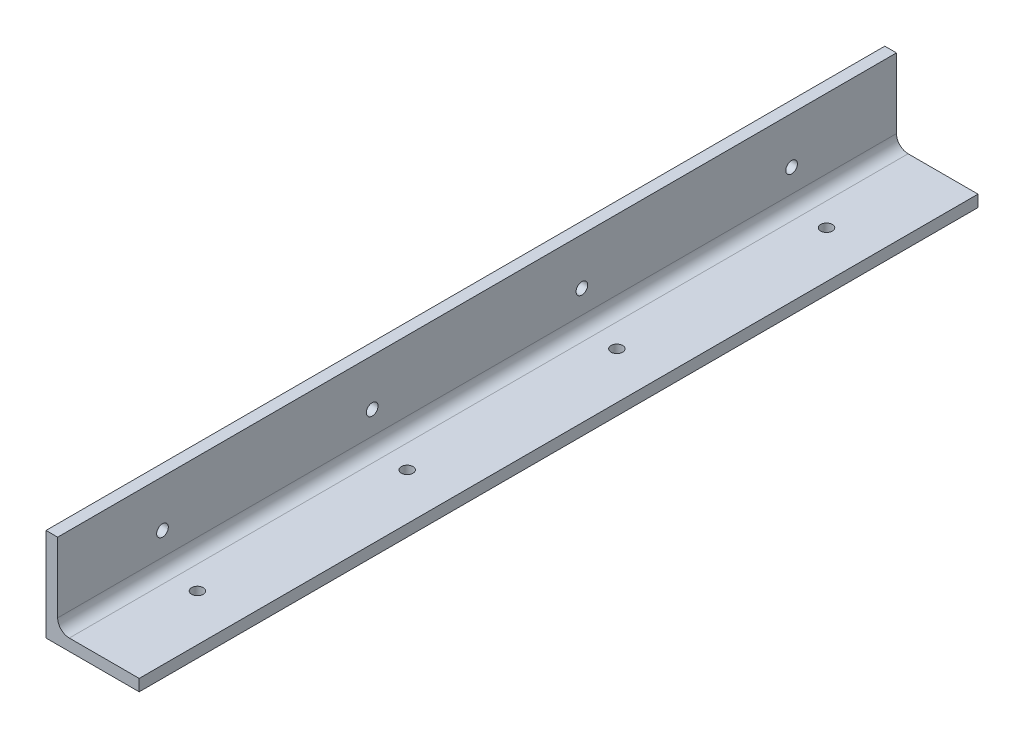
ISO-10303-21;
HEADER;
FILE_DESCRIPTION(('STEP AP214'),'2;1');
FILE_NAME('part.step','',(''),(''),'','','');
FILE_SCHEMA(('AUTOMOTIVE_DESIGN { 1 0 10303 214 1 1 1 1 }'));
ENDSEC;
DATA;
#1=APPLICATION_CONTEXT('core data for automotive mechanical design processes');
#2=APPLICATION_PROTOCOL_DEFINITION('international standard','automotive_design',2000,#1);
#3=PRODUCT_CONTEXT('',#1,'mechanical');
#4=PRODUCT('Part','Part','',(#3));
#5=PRODUCT_RELATED_PRODUCT_CATEGORY('part','',(#4));
#6=PRODUCT_DEFINITION_FORMATION('','',#4);
#7=PRODUCT_DEFINITION_CONTEXT('part definition',#1,'design');
#8=PRODUCT_DEFINITION('design','',#6,#7);
#9=PRODUCT_DEFINITION_SHAPE('','',#8);
#10=(LENGTH_UNIT() NAMED_UNIT(*) SI_UNIT(.MILLI.,.METRE.));
#11=(NAMED_UNIT(*) PLANE_ANGLE_UNIT() SI_UNIT($,.RADIAN.));
#12=(NAMED_UNIT(*) SI_UNIT($,.STERADIAN.) SOLID_ANGLE_UNIT());
#13=UNCERTAINTY_MEASURE_WITH_UNIT(LENGTH_MEASURE(1.E-05),#10,'distance_accuracy_value','');
#14=(GEOMETRIC_REPRESENTATION_CONTEXT(3) GLOBAL_UNCERTAINTY_ASSIGNED_CONTEXT((#13)) GLOBAL_UNIT_ASSIGNED_CONTEXT((#10,
#11,#12)) REPRESENTATION_CONTEXT('',''));
#15=CARTESIAN_POINT('',(0.,0.,0.));
#16=DIRECTION('',(0.,0.,1.));
#17=DIRECTION('',(1.,0.,0.));
#18=AXIS2_PLACEMENT_3D('',#15,#16,#17);
#19=CARTESIAN_POINT('',(-29.6093607133629,-1.95308723282948,57.15));
#20=DIRECTION('',(-1.,0.,0.));
#21=DIRECTION('',(0.,0.,1.));
#22=AXIS2_PLACEMENT_3D('',#19,#20,#21);
#23=CYLINDRICAL_SURFACE('',#22,3.17499999999999);
#24=CARTESIAN_POINT('',(-29.6093607133629,-1.95308723282948,57.15));
#25=DIRECTION('',(-1.,0.,0.));
#26=DIRECTION('',(0.,0.,1.));
#27=AXIS2_PLACEMENT_3D('',#24,#25,#26);
#28=CIRCLE('',#27,3.17499999999999);
#29=CARTESIAN_POINT('',(-29.6093607133629,-1.95308723282948,60.325));
#30=VERTEX_POINT('',#29);
#31=EDGE_CURVE('E55',#30,#30,#28,.T.);
#32=ORIENTED_EDGE('',*,*,#31,.T.);
#33=EDGE_LOOP('',(#32));
#34=FACE_BOUND('',#33,.T.);
#35=CARTESIAN_POINT('',(-23.2593607133629,-1.95308723282948,57.15));
#36=DIRECTION('',(-1.,0.,0.));
#37=DIRECTION('',(0.,0.,1.));
#38=AXIS2_PLACEMENT_3D('',#35,#36,#37);
#39=CIRCLE('',#38,3.17499999999999);
#40=CARTESIAN_POINT('',(-23.2593607133629,-1.95308723282948,60.325));
#41=VERTEX_POINT('',#40);
#42=EDGE_CURVE('E11',#41,#41,#39,.T.);
#43=ORIENTED_EDGE('',*,*,#42,.F.);
#44=EDGE_LOOP('',(#43));
#45=FACE_BOUND('',#44,.T.);
#46=ADVANCED_FACE('F47',(#34,#45),#23,.F.);
#47=CARTESIAN_POINT('',(-29.6093607133629,-1.95308723282948,171.45));
#48=DIRECTION('',(-1.,0.,0.));
#49=DIRECTION('',(0.,0.,1.));
#50=AXIS2_PLACEMENT_3D('',#47,#48,#49);
#51=CYLINDRICAL_SURFACE('',#50,3.17499999999999);
#52=CARTESIAN_POINT('',(-29.6093607133629,-1.95308723282948,171.45));
#53=DIRECTION('',(-1.,0.,0.));
#54=DIRECTION('',(0.,0.,1.));
#55=AXIS2_PLACEMENT_3D('',#52,#53,#54);
#56=CIRCLE('',#55,3.17499999999999);
#57=CARTESIAN_POINT('',(-29.6093607133629,-1.95308723282948,174.625));
#58=VERTEX_POINT('',#57);
#59=EDGE_CURVE('E210',#58,#58,#56,.T.);
#60=ORIENTED_EDGE('',*,*,#59,.T.);
#61=EDGE_LOOP('',(#60));
#62=FACE_BOUND('',#61,.T.);
#63=CARTESIAN_POINT('',(-23.2593607133629,-1.95308723282948,171.45));
#64=DIRECTION('',(-1.,0.,0.));
#65=DIRECTION('',(0.,0.,1.));
#66=AXIS2_PLACEMENT_3D('',#63,#64,#65);
#67=CIRCLE('',#66,3.17499999999999);
#68=CARTESIAN_POINT('',(-23.2593607133629,-1.95308723282948,174.625));
#69=VERTEX_POINT('',#68);
#70=EDGE_CURVE('E214',#69,#69,#67,.T.);
#71=ORIENTED_EDGE('',*,*,#70,.F.);
#72=EDGE_LOOP('',(#71));
#73=FACE_BOUND('',#72,.T.);
#74=ADVANCED_FACE('F250',(#62,#73),#51,.F.);
#75=CARTESIAN_POINT('',(-4.20936071336289,-27.3530872328295,57.15));
#76=DIRECTION('',(0.,-1.,0.));
#77=DIRECTION('',(0.,0.,-1.));
#78=AXIS2_PLACEMENT_3D('',#75,#76,#77);
#79=CYLINDRICAL_SURFACE('',#78,3.17499999999999);
#80=CARTESIAN_POINT('',(-4.20936071336289,-21.0030872328295,57.15));
#81=DIRECTION('',(0.,1.,0.));
#82=DIRECTION('',(0.,0.,1.));
#83=AXIS2_PLACEMENT_3D('',#80,#81,#82);
#84=CIRCLE('',#83,3.17499999999999);
#85=CARTESIAN_POINT('',(-4.20936071336289,-21.0030872328295,60.325));
#86=VERTEX_POINT('',#85);
#87=EDGE_CURVE('E202',#86,#86,#84,.T.);
#88=ORIENTED_EDGE('',*,*,#87,.T.);
#89=EDGE_LOOP('',(#88));
#90=FACE_BOUND('',#89,.T.);
#91=CARTESIAN_POINT('',(-4.20936071336289,-27.3530872328295,57.15));
#92=DIRECTION('',(0.,-1.,0.));
#93=DIRECTION('',(0.,0.,-1.));
#94=AXIS2_PLACEMENT_3D('',#91,#92,#93);
#95=CIRCLE('',#94,3.17499999999999);
#96=CARTESIAN_POINT('',(-4.20936071336289,-27.3530872328295,53.975));
#97=VERTEX_POINT('',#96);
#98=EDGE_CURVE('E206',#97,#97,#95,.T.);
#99=ORIENTED_EDGE('',*,*,#98,.T.);
#100=EDGE_LOOP('',(#99));
#101=FACE_BOUND('',#100,.T.);
#102=ADVANCED_FACE('F255',(#90,#101),#79,.F.);
#103=CARTESIAN_POINT('',(-4.20936071336289,-27.3530872328295,171.45));
#104=DIRECTION('',(0.,-1.,0.));
#105=DIRECTION('',(0.,0.,-1.));
#106=AXIS2_PLACEMENT_3D('',#103,#104,#105);
#107=CYLINDRICAL_SURFACE('',#106,3.17499999999999);
#108=CARTESIAN_POINT('',(-4.20936071336289,-21.0030872328295,171.45));
#109=DIRECTION('',(0.,1.,0.));
#110=DIRECTION('',(0.,0.,1.));
#111=AXIS2_PLACEMENT_3D('',#108,#109,#110);
#112=CIRCLE('',#111,3.17499999999999);
#113=CARTESIAN_POINT('',(-4.20936071336289,-21.0030872328295,174.625));
#114=VERTEX_POINT('',#113);
#115=EDGE_CURVE('E194',#114,#114,#112,.T.);
#116=ORIENTED_EDGE('',*,*,#115,.T.);
#117=EDGE_LOOP('',(#116));
#118=FACE_BOUND('',#117,.T.);
#119=CARTESIAN_POINT('',(-4.20936071336289,-27.3530872328295,171.45));
#120=DIRECTION('',(0.,-1.,0.));
#121=DIRECTION('',(0.,0.,-1.));
#122=AXIS2_PLACEMENT_3D('',#119,#120,#121);
#123=CIRCLE('',#122,3.17499999999999);
#124=CARTESIAN_POINT('',(-4.20936071336289,-27.3530872328295,168.275));
#125=VERTEX_POINT('',#124);
#126=EDGE_CURVE('E198',#125,#125,#123,.T.);
#127=ORIENTED_EDGE('',*,*,#126,.T.);
#128=EDGE_LOOP('',(#127));
#129=FACE_BOUND('',#128,.T.);
#130=ADVANCED_FACE('F260',(#118,#129),#107,.F.);
#131=CARTESIAN_POINT('',(0.,0.,457.2));
#132=DIRECTION('',(0.,0.,-1.));
#133=DIRECTION('',(-1.,0.,0.));
#134=AXIS2_PLACEMENT_3D('',#131,#132,#133);
#135=PLANE('',#134);
#136=DIRECTION('',(0.,1.,0.));
#137=VECTOR('',#136,1.);
#138=CARTESIAN_POINT('',(-29.6093607133629,-21.0030872328295,457.2));
#139=LINE('',#138,#137);
#140=CARTESIAN_POINT('',(-29.6093607133629,-27.3530872328295,457.2));
#141=VERTEX_POINT('',#140);
#142=CARTESIAN_POINT('',(-29.6093607133629,23.4469127671705,457.2));
#143=VERTEX_POINT('',#142);
#144=EDGE_CURVE('E122',#141,#143,#139,.T.);
#145=ORIENTED_EDGE('',*,*,#144,.F.);
#146=DIRECTION('',(1.,0.,0.));
#147=VECTOR('',#146,1.);
#148=CARTESIAN_POINT('',(-29.6093607133629,-27.3530872328295,457.2));
#149=LINE('',#148,#147);
#150=CARTESIAN_POINT('',(21.1906392866371,-27.3530872328295,457.2));
#151=VERTEX_POINT('',#150);
#152=EDGE_CURVE('E154',#141,#151,#149,.T.);
#153=ORIENTED_EDGE('',*,*,#152,.T.);
#154=DIRECTION('',(0.,-1.,0.));
#155=VECTOR('',#154,1.);
#156=CARTESIAN_POINT('',(21.1906392866371,-21.0030872328295,457.2));
#157=LINE('',#156,#155);
#158=CARTESIAN_POINT('',(21.1906392866371,-21.0030872328295,457.2));
#159=VERTEX_POINT('',#158);
#160=EDGE_CURVE('E157',#159,#151,#157,.T.);
#161=ORIENTED_EDGE('',*,*,#160,.F.);
#162=DIRECTION('',(1.,0.,0.));
#163=VECTOR('',#162,1.);
#164=CARTESIAN_POINT('',(-29.6093607133629,-21.0030872328295,457.2));
#165=LINE('',#164,#163);
#166=CARTESIAN_POINT('',(-16.9093607133629,-21.0030872328295,457.2));
#167=VERTEX_POINT('',#166);
#168=EDGE_CURVE('E162',#167,#159,#165,.T.);
#169=ORIENTED_EDGE('',*,*,#168,.F.);
#170=CARTESIAN_POINT('',(-16.9093607133629,-14.6530872328295,457.2));
#171=DIRECTION('',(0.,0.,-1.));
#172=DIRECTION('',(-1.,0.,0.));
#173=AXIS2_PLACEMENT_3D('',#170,#171,#172);
#174=CIRCLE('',#173,6.35);
#175=CARTESIAN_POINT('',(-23.2593607133629,-14.6530872328295,457.2));
#176=VERTEX_POINT('',#175);
#177=EDGE_CURVE('E191',#167,#176,#174,.T.);
#178=ORIENTED_EDGE('',*,*,#177,.T.);
#179=DIRECTION('',(0.,1.,0.));
#180=VECTOR('',#179,1.);
#181=CARTESIAN_POINT('',(-23.2593607133629,-21.0030872328295,457.2));
#182=LINE('',#181,#180);
#183=CARTESIAN_POINT('',(-23.2593607133629,23.4469127671705,457.2));
#184=VERTEX_POINT('',#183);
#185=EDGE_CURVE('E118',#176,#184,#182,.T.);
#186=ORIENTED_EDGE('',*,*,#185,.T.);
#187=DIRECTION('',(1.,0.,0.));
#188=VECTOR('',#187,1.);
#189=CARTESIAN_POINT('',(-29.6093607133629,23.4469127671705,457.2));
#190=LINE('',#189,#188);
#191=EDGE_CURVE('E110',#143,#184,#190,.T.);
#192=ORIENTED_EDGE('',*,*,#191,.F.);
#193=EDGE_LOOP('',(#145,#153,#161,#169,#178,#186,#192));
#194=FACE_BOUND('',#193,.T.);
#195=ADVANCED_FACE('F121',(#194),#135,.F.);
#196=CARTESIAN_POINT('',(-29.6093607133629,23.4469127671705,457.2));
#197=DIRECTION('',(0.,1.,0.));
#198=DIRECTION('',(0.,0.,1.));
#199=AXIS2_PLACEMENT_3D('',#196,#197,#198);
#200=PLANE('',#199);
#201=DIRECTION('',(1.,0.,0.));
#202=VECTOR('',#201,1.);
#203=CARTESIAN_POINT('',(-29.6093607133629,23.4469127671705,0.));
#204=LINE('',#203,#202);
#205=CARTESIAN_POINT('',(-29.6093607133629,23.4469127671705,0.));
#206=VERTEX_POINT('',#205);
#207=CARTESIAN_POINT('',(-23.2593607133629,23.4469127671705,0.));
#208=VERTEX_POINT('',#207);
#209=EDGE_CURVE('E112',#206,#208,#204,.T.);
#210=ORIENTED_EDGE('',*,*,#209,.F.);
#211=DIRECTION('',(0.,0.,-1.));
#212=VECTOR('',#211,1.);
#213=CARTESIAN_POINT('',(-29.6093607133629,23.4469127671705,457.2));
#214=LINE('',#213,#212);
#215=EDGE_CURVE('E106',#143,#206,#214,.T.);
#216=ORIENTED_EDGE('',*,*,#215,.F.);
#217=ORIENTED_EDGE('',*,*,#191,.T.);
#218=DIRECTION('',(0.,0.,-1.));
#219=VECTOR('',#218,1.);
#220=CARTESIAN_POINT('',(-23.2593607133629,23.4469127671705,457.2));
#221=LINE('',#220,#219);
#222=EDGE_CURVE('E117',#184,#208,#221,.T.);
#223=ORIENTED_EDGE('',*,*,#222,.T.);
#224=EDGE_LOOP('',(#210,#216,#217,#223));
#225=FACE_BOUND('',#224,.T.);
#226=ADVANCED_FACE('F108',(#225),#200,.T.);
#227=CARTESIAN_POINT('',(0.,0.,0.));
#228=DIRECTION('',(0.,0.,-1.));
#229=DIRECTION('',(-1.,0.,0.));
#230=AXIS2_PLACEMENT_3D('',#227,#228,#229);
#231=PLANE('',#230);
#232=DIRECTION('',(0.,1.,0.));
#233=VECTOR('',#232,1.);
#234=CARTESIAN_POINT('',(-29.6093607133629,-21.0030872328295,0.));
#235=LINE('',#234,#233);
#236=CARTESIAN_POINT('',(-29.6093607133629,-27.3530872328295,0.));
#237=VERTEX_POINT('',#236);
#238=EDGE_CURVE('E146',#237,#206,#235,.T.);
#239=ORIENTED_EDGE('',*,*,#238,.T.);
#240=ORIENTED_EDGE('',*,*,#209,.T.);
#241=DIRECTION('',(0.,1.,0.));
#242=VECTOR('',#241,1.);
#243=CARTESIAN_POINT('',(-23.2593607133629,-21.0030872328295,0.));
#244=LINE('',#243,#242);
#245=CARTESIAN_POINT('',(-23.2593607133629,-14.6530872328295,0.));
#246=VERTEX_POINT('',#245);
#247=EDGE_CURVE('E134',#246,#208,#244,.T.);
#248=ORIENTED_EDGE('',*,*,#247,.F.);
#249=CARTESIAN_POINT('',(-16.9093607133629,-14.6530872328295,0.));
#250=DIRECTION('',(0.,0.,-1.));
#251=DIRECTION('',(-1.,0.,0.));
#252=AXIS2_PLACEMENT_3D('',#249,#250,#251);
#253=CIRCLE('',#252,6.35);
#254=CARTESIAN_POINT('',(-16.9093607133629,-21.0030872328295,0.));
#255=VERTEX_POINT('',#254);
#256=EDGE_CURVE('E62',#246,#255,#253,.F.);
#257=ORIENTED_EDGE('',*,*,#256,.T.);
#258=DIRECTION('',(1.,0.,0.));
#259=VECTOR('',#258,1.);
#260=CARTESIAN_POINT('',(-29.6093607133629,-21.0030872328295,0.));
#261=LINE('',#260,#259);
#262=CARTESIAN_POINT('',(21.1906392866371,-21.0030872328295,0.));
#263=VERTEX_POINT('',#262);
#264=EDGE_CURVE('E158',#255,#263,#261,.T.);
#265=ORIENTED_EDGE('',*,*,#264,.T.);
#266=DIRECTION('',(0.,-1.,0.));
#267=VECTOR('',#266,1.);
#268=CARTESIAN_POINT('',(21.1906392866371,-21.0030872328295,0.));
#269=LINE('',#268,#267);
#270=CARTESIAN_POINT('',(21.1906392866371,-27.3530872328295,0.));
#271=VERTEX_POINT('',#270);
#272=EDGE_CURVE('E170',#263,#271,#269,.T.);
#273=ORIENTED_EDGE('',*,*,#272,.T.);
#274=DIRECTION('',(1.,0.,0.));
#275=VECTOR('',#274,1.);
#276=CARTESIAN_POINT('',(-29.6093607133629,-27.3530872328295,0.));
#277=LINE('',#276,#275);
#278=EDGE_CURVE('E166',#237,#271,#277,.T.);
#279=ORIENTED_EDGE('',*,*,#278,.F.);
#280=EDGE_LOOP('',(#239,#240,#248,#257,#265,#273,#279));
#281=FACE_BOUND('',#280,.T.);
#282=ADVANCED_FACE('F239',(#281),#231,.T.);
#283=CARTESIAN_POINT('',(-23.2593607133629,-21.0030872328295,457.2));
#284=DIRECTION('',(-1.,0.,0.));
#285=DIRECTION('',(0.,0.,1.));
#286=AXIS2_PLACEMENT_3D('',#283,#284,#285);
#287=PLANE('',#286);
#288=CARTESIAN_POINT('',(-23.2593607133629,-1.95308723282948,285.75));
#289=DIRECTION('',(-1.,0.,0.));
#290=DIRECTION('',(0.,0.,1.));
#291=AXIS2_PLACEMENT_3D('',#288,#289,#290);
#292=CIRCLE('',#291,3.17499999999999);
#293=CARTESIAN_POINT('',(-23.2593607133629,-1.95308723282948,288.925));
#294=VERTEX_POINT('',#293);
#295=EDGE_CURVE('E326',#294,#294,#292,.T.);
#296=ORIENTED_EDGE('',*,*,#295,.T.);
#297=EDGE_LOOP('',(#296));
#298=FACE_BOUND('',#297,.T.);
#299=CARTESIAN_POINT('',(-23.2593607133629,-1.95308723282948,400.05));
#300=DIRECTION('',(-1.,0.,0.));
#301=DIRECTION('',(0.,0.,1.));
#302=AXIS2_PLACEMENT_3D('',#299,#300,#301);
#303=CIRCLE('',#302,3.17499999999999);
#304=CARTESIAN_POINT('',(-23.2593607133629,-1.95308723282948,403.225));
#305=VERTEX_POINT('',#304);
#306=EDGE_CURVE('E335',#305,#305,#303,.T.);
#307=ORIENTED_EDGE('',*,*,#306,.T.);
#308=EDGE_LOOP('',(#307));
#309=FACE_BOUND('',#308,.T.);
#310=ORIENTED_EDGE('',*,*,#185,.F.);
#311=DIRECTION('',(0.,0.,-1.));
#312=VECTOR('',#311,1.);
#313=CARTESIAN_POINT('',(-23.2593607133629,-14.6530872328295,457.2));
#314=LINE('',#313,#312);
#315=EDGE_CURVE('E152',#176,#246,#314,.T.);
#316=ORIENTED_EDGE('',*,*,#315,.T.);
#317=ORIENTED_EDGE('',*,*,#247,.T.);
#318=ORIENTED_EDGE('',*,*,#222,.F.);
#319=EDGE_LOOP('',(#310,#316,#317,#318));
#320=FACE_BOUND('',#319,.T.);
#321=ORIENTED_EDGE('',*,*,#70,.T.);
#322=EDGE_LOOP('',(#321));
#323=FACE_BOUND('',#322,.T.);
#324=ORIENTED_EDGE('',*,*,#42,.T.);
#325=EDGE_LOOP('',(#324));
#326=FACE_BOUND('',#325,.T.);
#327=ADVANCED_FACE('F227',(#298,#309,#320,#323,#326),#287,.F.);
#328=CARTESIAN_POINT('',(-29.6093607133629,-21.0030872328295,457.2));
#329=DIRECTION('',(-1.,0.,0.));
#330=DIRECTION('',(0.,0.,1.));
#331=AXIS2_PLACEMENT_3D('',#328,#329,#330);
#332=PLANE('',#331);
#333=CARTESIAN_POINT('',(-29.6093607133629,-1.95308723282948,285.75));
#334=DIRECTION('',(-1.,0.,0.));
#335=DIRECTION('',(0.,0.,1.));
#336=AXIS2_PLACEMENT_3D('',#333,#334,#335);
#337=CIRCLE('',#336,3.17499999999999);
#338=CARTESIAN_POINT('',(-29.6093607133629,-1.95308723282948,288.925));
#339=VERTEX_POINT('',#338);
#340=EDGE_CURVE('E323',#339,#339,#337,.T.);
#341=ORIENTED_EDGE('',*,*,#340,.F.);
#342=EDGE_LOOP('',(#341));
#343=FACE_BOUND('',#342,.T.);
#344=CARTESIAN_POINT('',(-29.6093607133629,-1.95308723282948,400.05));
#345=DIRECTION('',(-1.,0.,0.));
#346=DIRECTION('',(0.,0.,1.));
#347=AXIS2_PLACEMENT_3D('',#344,#345,#346);
#348=CIRCLE('',#347,3.17499999999999);
#349=CARTESIAN_POINT('',(-29.6093607133629,-1.95308723282948,403.225));
#350=VERTEX_POINT('',#349);
#351=EDGE_CURVE('E328',#350,#350,#348,.T.);
#352=ORIENTED_EDGE('',*,*,#351,.F.);
#353=EDGE_LOOP('',(#352));
#354=FACE_BOUND('',#353,.T.);
#355=ORIENTED_EDGE('',*,*,#238,.F.);
#356=DIRECTION('',(0.,0.,-1.));
#357=VECTOR('',#356,1.);
#358=CARTESIAN_POINT('',(-29.6093607133629,-27.3530872328295,457.2));
#359=LINE('',#358,#357);
#360=EDGE_CURVE('E132',#141,#237,#359,.T.);
#361=ORIENTED_EDGE('',*,*,#360,.F.);
#362=ORIENTED_EDGE('',*,*,#144,.T.);
#363=ORIENTED_EDGE('',*,*,#215,.T.);
#364=EDGE_LOOP('',(#355,#361,#362,#363));
#365=FACE_BOUND('',#364,.T.);
#366=ORIENTED_EDGE('',*,*,#59,.F.);
#367=EDGE_LOOP('',(#366));
#368=FACE_BOUND('',#367,.T.);
#369=ORIENTED_EDGE('',*,*,#31,.F.);
#370=EDGE_LOOP('',(#369));
#371=FACE_BOUND('',#370,.T.);
#372=ADVANCED_FACE('F129',(#343,#354,#365,#368,#371),#332,.T.);
#373=CARTESIAN_POINT('',(-29.6093607133629,-27.3530872328295,457.2));
#374=DIRECTION('',(0.,1.,0.));
#375=DIRECTION('',(0.,0.,1.));
#376=AXIS2_PLACEMENT_3D('',#373,#374,#375);
#377=PLANE('',#376);
#378=CARTESIAN_POINT('',(-4.20936071336289,-27.3530872328295,285.75));
#379=DIRECTION('',(0.,-1.,0.));
#380=DIRECTION('',(0.,0.,-1.));
#381=AXIS2_PLACEMENT_3D('',#378,#379,#380);
#382=CIRCLE('',#381,3.17499999999999);
#383=CARTESIAN_POINT('',(-4.20936071336289,-27.3530872328295,282.575));
#384=VERTEX_POINT('',#383);
#385=EDGE_CURVE('E346',#384,#384,#382,.T.);
#386=ORIENTED_EDGE('',*,*,#385,.F.);
#387=EDGE_LOOP('',(#386));
#388=FACE_BOUND('',#387,.T.);
#389=CARTESIAN_POINT('',(-4.20936071336289,-27.3530872328295,400.05));
#390=DIRECTION('',(0.,-1.,0.));
#391=DIRECTION('',(0.,0.,-1.));
#392=AXIS2_PLACEMENT_3D('',#389,#390,#391);
#393=CIRCLE('',#392,3.17499999999999);
#394=CARTESIAN_POINT('',(-4.20936071336289,-27.3530872328295,396.875));
#395=VERTEX_POINT('',#394);
#396=EDGE_CURVE('E349',#395,#395,#393,.T.);
#397=ORIENTED_EDGE('',*,*,#396,.F.);
#398=EDGE_LOOP('',(#397));
#399=FACE_BOUND('',#398,.T.);
#400=ORIENTED_EDGE('',*,*,#278,.T.);
#401=DIRECTION('',(0.,0.,-1.));
#402=VECTOR('',#401,1.);
#403=CARTESIAN_POINT('',(21.1906392866371,-27.3530872328295,457.2));
#404=LINE('',#403,#402);
#405=EDGE_CURVE('E179',#151,#271,#404,.T.);
#406=ORIENTED_EDGE('',*,*,#405,.F.);
#407=ORIENTED_EDGE('',*,*,#152,.F.);
#408=ORIENTED_EDGE('',*,*,#360,.T.);
#409=EDGE_LOOP('',(#400,#406,#407,#408));
#410=FACE_BOUND('',#409,.T.);
#411=ORIENTED_EDGE('',*,*,#126,.F.);
#412=EDGE_LOOP('',(#411));
#413=FACE_BOUND('',#412,.T.);
#414=ORIENTED_EDGE('',*,*,#98,.F.);
#415=EDGE_LOOP('',(#414));
#416=FACE_BOUND('',#415,.T.);
#417=ADVANCED_FACE('F226',(#388,#399,#410,#413,#416),#377,.F.);
#418=CARTESIAN_POINT('',(21.1906392866371,-21.0030872328295,457.2));
#419=DIRECTION('',(1.,0.,0.));
#420=DIRECTION('',(0.,0.,-1.));
#421=AXIS2_PLACEMENT_3D('',#418,#419,#420);
#422=PLANE('',#421);
#423=ORIENTED_EDGE('',*,*,#272,.F.);
#424=DIRECTION('',(0.,0.,-1.));
#425=VECTOR('',#424,1.);
#426=CARTESIAN_POINT('',(21.1906392866371,-21.0030872328295,457.2));
#427=LINE('',#426,#425);
#428=EDGE_CURVE('E165',#159,#263,#427,.T.);
#429=ORIENTED_EDGE('',*,*,#428,.F.);
#430=ORIENTED_EDGE('',*,*,#160,.T.);
#431=ORIENTED_EDGE('',*,*,#405,.T.);
#432=EDGE_LOOP('',(#423,#429,#430,#431));
#433=FACE_BOUND('',#432,.T.);
#434=ADVANCED_FACE('F236',(#433),#422,.T.);
#435=CARTESIAN_POINT('',(-29.6093607133629,-21.0030872328295,457.2));
#436=DIRECTION('',(0.,1.,0.));
#437=DIRECTION('',(0.,0.,1.));
#438=AXIS2_PLACEMENT_3D('',#435,#436,#437);
#439=PLANE('',#438);
#440=CARTESIAN_POINT('',(-4.20936071336289,-21.0030872328295,285.75));
#441=DIRECTION('',(0.,1.,0.));
#442=DIRECTION('',(0.,0.,1.));
#443=AXIS2_PLACEMENT_3D('',#440,#441,#442);
#444=CIRCLE('',#443,3.17499999999999);
#445=CARTESIAN_POINT('',(-4.20936071336289,-21.0030872328295,288.925));
#446=VERTEX_POINT('',#445);
#447=EDGE_CURVE('E342',#446,#446,#444,.T.);
#448=ORIENTED_EDGE('',*,*,#447,.F.);
#449=EDGE_LOOP('',(#448));
#450=FACE_BOUND('',#449,.T.);
#451=CARTESIAN_POINT('',(-4.20936071336289,-21.0030872328295,400.05));
#452=DIRECTION('',(0.,1.,0.));
#453=DIRECTION('',(0.,0.,1.));
#454=AXIS2_PLACEMENT_3D('',#451,#452,#453);
#455=CIRCLE('',#454,3.17499999999999);
#456=CARTESIAN_POINT('',(-4.20936071336289,-21.0030872328295,403.225));
#457=VERTEX_POINT('',#456);
#458=EDGE_CURVE('E141',#457,#457,#455,.T.);
#459=ORIENTED_EDGE('',*,*,#458,.F.);
#460=EDGE_LOOP('',(#459));
#461=FACE_BOUND('',#460,.T.);
#462=ORIENTED_EDGE('',*,*,#264,.F.);
#463=DIRECTION('',(0.,0.,-1.));
#464=VECTOR('',#463,1.);
#465=CARTESIAN_POINT('',(-16.9093607133629,-21.0030872328295,457.2));
#466=LINE('',#465,#464);
#467=EDGE_CURVE('E69',#255,#167,#466,.F.);
#468=ORIENTED_EDGE('',*,*,#467,.T.);
#469=ORIENTED_EDGE('',*,*,#168,.T.);
#470=ORIENTED_EDGE('',*,*,#428,.T.);
#471=EDGE_LOOP('',(#462,#468,#469,#470));
#472=FACE_BOUND('',#471,.T.);
#473=ORIENTED_EDGE('',*,*,#115,.F.);
#474=EDGE_LOOP('',(#473));
#475=FACE_BOUND('',#474,.T.);
#476=ORIENTED_EDGE('',*,*,#87,.F.);
#477=EDGE_LOOP('',(#476));
#478=FACE_BOUND('',#477,.T.);
#479=ADVANCED_FACE('F230',(#450,#461,#472,#475,#478),#439,.T.);
#480=CARTESIAN_POINT('',(-16.9093607133629,-14.6530872328295,457.2));
#481=DIRECTION('',(0.,0.,-1.));
#482=DIRECTION('',(-1.,0.,0.));
#483=AXIS2_PLACEMENT_3D('',#480,#481,#482);
#484=CYLINDRICAL_SURFACE('',#483,6.35);
#485=ORIENTED_EDGE('',*,*,#177,.F.);
#486=ORIENTED_EDGE('',*,*,#467,.F.);
#487=ORIENTED_EDGE('',*,*,#256,.F.);
#488=ORIENTED_EDGE('',*,*,#315,.F.);
#489=EDGE_LOOP('',(#485,#486,#487,#488));
#490=FACE_BOUND('',#489,.T.);
#491=ADVANCED_FACE('F247',(#490),#484,.F.);
#492=CARTESIAN_POINT('',(-4.20936071336289,-27.3530872328295,400.05));
#493=DIRECTION('',(0.,-1.,0.));
#494=DIRECTION('',(0.,0.,-1.));
#495=AXIS2_PLACEMENT_3D('',#492,#493,#494);
#496=CYLINDRICAL_SURFACE('',#495,3.17499999999999);
#497=ORIENTED_EDGE('',*,*,#458,.T.);
#498=EDGE_LOOP('',(#497));
#499=FACE_BOUND('',#498,.T.);
#500=ORIENTED_EDGE('',*,*,#396,.T.);
#501=EDGE_LOOP('',(#500));
#502=FACE_BOUND('',#501,.T.);
#503=ADVANCED_FACE('F269',(#499,#502),#496,.F.);
#504=CARTESIAN_POINT('',(-4.20936071336289,-27.3530872328295,285.75));
#505=DIRECTION('',(0.,-1.,0.));
#506=DIRECTION('',(0.,0.,-1.));
#507=AXIS2_PLACEMENT_3D('',#504,#505,#506);
#508=CYLINDRICAL_SURFACE('',#507,3.17499999999999);
#509=ORIENTED_EDGE('',*,*,#447,.T.);
#510=EDGE_LOOP('',(#509));
#511=FACE_BOUND('',#510,.T.);
#512=ORIENTED_EDGE('',*,*,#385,.T.);
#513=EDGE_LOOP('',(#512));
#514=FACE_BOUND('',#513,.T.);
#515=ADVANCED_FACE('F309',(#511,#514),#508,.F.);
#516=CARTESIAN_POINT('',(-29.6093607133629,-1.95308723282948,400.05));
#517=DIRECTION('',(-1.,0.,0.));
#518=DIRECTION('',(0.,0.,1.));
#519=AXIS2_PLACEMENT_3D('',#516,#517,#518);
#520=CYLINDRICAL_SURFACE('',#519,3.17499999999999);
#521=ORIENTED_EDGE('',*,*,#351,.T.);
#522=EDGE_LOOP('',(#521));
#523=FACE_BOUND('',#522,.T.);
#524=ORIENTED_EDGE('',*,*,#306,.F.);
#525=EDGE_LOOP('',(#524));
#526=FACE_BOUND('',#525,.T.);
#527=ADVANCED_FACE('F313',(#523,#526),#520,.F.);
#528=CARTESIAN_POINT('',(-29.6093607133629,-1.95308723282948,285.75));
#529=DIRECTION('',(-1.,0.,0.));
#530=DIRECTION('',(0.,0.,1.));
#531=AXIS2_PLACEMENT_3D('',#528,#529,#530);
#532=CYLINDRICAL_SURFACE('',#531,3.17499999999999);
#533=ORIENTED_EDGE('',*,*,#340,.T.);
#534=EDGE_LOOP('',(#533));
#535=FACE_BOUND('',#534,.T.);
#536=ORIENTED_EDGE('',*,*,#295,.F.);
#537=EDGE_LOOP('',(#536));
#538=FACE_BOUND('',#537,.T.);
#539=ADVANCED_FACE('F316',(#535,#538),#532,.F.);
#540=CLOSED_SHELL('',(#46,#74,#102,#130,#195,#226,#282,#327,#372,#417,#434,#479,#491,#503,#515,
#527,#539));
#541=MANIFOLD_SOLID_BREP('B2',#540);
#542=ADVANCED_BREP_SHAPE_REPRESENTATION('',(#18,#541),#14);
#543=SHAPE_DEFINITION_REPRESENTATION(#9,#542);
ENDSEC;
END-ISO-10303-21;
